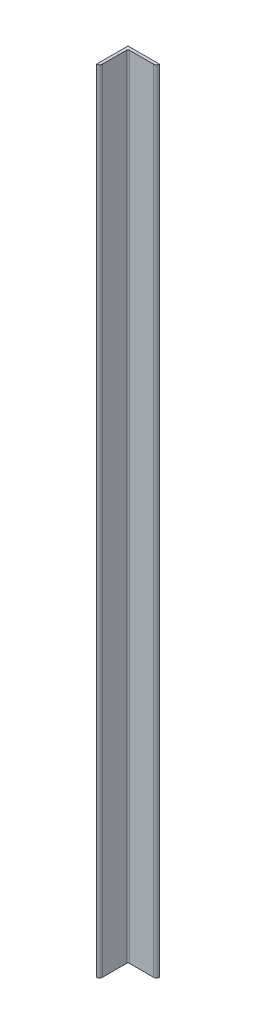
ISO-10303-21;
HEADER;
FILE_DESCRIPTION(('STEP AP214'),'2;1');
FILE_NAME('part.step','',(''),(''),'','','');
FILE_SCHEMA(('AUTOMOTIVE_DESIGN { 1 0 10303 214 1 1 1 1 }'));
ENDSEC;
DATA;
#1=APPLICATION_CONTEXT('core data for automotive mechanical design processes');
#2=APPLICATION_PROTOCOL_DEFINITION('international standard','automotive_design',2000,#1);
#3=PRODUCT_CONTEXT('',#1,'mechanical');
#4=PRODUCT('Part','Part','',(#3));
#5=PRODUCT_RELATED_PRODUCT_CATEGORY('part','',(#4));
#6=PRODUCT_DEFINITION_FORMATION('','',#4);
#7=PRODUCT_DEFINITION_CONTEXT('part definition',#1,'design');
#8=PRODUCT_DEFINITION('design','',#6,#7);
#9=PRODUCT_DEFINITION_SHAPE('','',#8);
#10=(LENGTH_UNIT() NAMED_UNIT(*) SI_UNIT(.MILLI.,.METRE.));
#11=(NAMED_UNIT(*) PLANE_ANGLE_UNIT() SI_UNIT($,.RADIAN.));
#12=(NAMED_UNIT(*) SI_UNIT($,.STERADIAN.) SOLID_ANGLE_UNIT());
#13=UNCERTAINTY_MEASURE_WITH_UNIT(LENGTH_MEASURE(1.E-05),#10,'distance_accuracy_value','');
#14=(GEOMETRIC_REPRESENTATION_CONTEXT(3) GLOBAL_UNCERTAINTY_ASSIGNED_CONTEXT((#13)) GLOBAL_UNIT_ASSIGNED_CONTEXT((#10,
#11,#12)) REPRESENTATION_CONTEXT('',''));
#15=CARTESIAN_POINT('',(0.,0.,0.));
#16=DIRECTION('',(0.,0.,1.));
#17=DIRECTION('',(1.,0.,0.));
#18=AXIS2_PLACEMENT_3D('',#15,#16,#17);
#19=CARTESIAN_POINT('',(92.08008,-1280.,0.00507999999993514));
#20=DIRECTION('',(0.,-1.,0.));
#21=DIRECTION('',(0.,0.,-1.));
#22=AXIS2_PLACEMENT_3D('',#19,#20,#21);
#23=PLANE('',#22);
#24=DIRECTION('',(0.,0.,1.));
#25=VECTOR('',#24,1.);
#26=CARTESIAN_POINT('',(0.,-1280.,101.6));
#27=LINE('',#26,#25);
#28=CARTESIAN_POINT('',(0.,-1280.,0.));
#29=VERTEX_POINT('',#28);
#30=CARTESIAN_POINT('',(0.,-1280.,101.6));
#31=VERTEX_POINT('',#30);
#32=EDGE_CURVE('E145',#29,#31,#27,.T.);
#33=ORIENTED_EDGE('',*,*,#32,.F.);
#34=DIRECTION('',(-1.,0.,0.));
#35=VECTOR('',#34,1.);
#36=CARTESIAN_POINT('',(0.,-1280.,0.));
#37=LINE('',#36,#35);
#38=CARTESIAN_POINT('',(101.6,-1280.,0.));
#39=VERTEX_POINT('',#38);
#40=EDGE_CURVE('E27',#39,#29,#37,.T.);
#41=ORIENTED_EDGE('',*,*,#40,.F.);
#42=DIRECTION('',(0.,0.,-1.));
#43=VECTOR('',#42,1.);
#44=CARTESIAN_POINT('',(101.6,-1280.,0.));
#45=LINE('',#44,#43);
#46=CARTESIAN_POINT('',(101.6,-1280.,0.00507999999993514));
#47=VERTEX_POINT('',#46);
#48=EDGE_CURVE('E149',#47,#39,#45,.T.);
#49=ORIENTED_EDGE('',*,*,#48,.F.);
#50=CARTESIAN_POINT('',(92.08008,-1280.,0.00507999999993514));
#51=DIRECTION('',(0.,1.,0.));
#52=DIRECTION('',(0.,0.,-1.));
#53=AXIS2_PLACEMENT_3D('',#50,#51,#52);
#54=CIRCLE('',#53,9.51992);
#55=CARTESIAN_POINT('',(92.08008,-1280.,9.525));
#56=VERTEX_POINT('',#55);
#57=EDGE_CURVE('E198',#56,#47,#54,.T.);
#58=ORIENTED_EDGE('',*,*,#57,.F.);
#59=DIRECTION('',(1.,0.,0.));
#60=VECTOR('',#59,1.);
#61=CARTESIAN_POINT('',(92.08008,-1280.,9.525));
#62=LINE('',#61,#60);
#63=CARTESIAN_POINT('',(14.2875,-1280.,9.525));
#64=VERTEX_POINT('',#63);
#65=EDGE_CURVE('E20',#64,#56,#62,.T.);
#66=ORIENTED_EDGE('',*,*,#65,.F.);
#67=CARTESIAN_POINT('',(14.2875,-1280.,14.2875));
#68=DIRECTION('',(0.,-1.,0.));
#69=DIRECTION('',(0.,0.,-1.));
#70=AXIS2_PLACEMENT_3D('',#67,#68,#69);
#71=CIRCLE('',#70,4.7625);
#72=CARTESIAN_POINT('',(9.525,-1280.,14.2875));
#73=VERTEX_POINT('',#72);
#74=EDGE_CURVE('E186',#73,#64,#71,.T.);
#75=ORIENTED_EDGE('',*,*,#74,.F.);
#76=DIRECTION('',(0.,0.,-1.));
#77=VECTOR('',#76,1.);
#78=CARTESIAN_POINT('',(9.525,-1280.,14.2875));
#79=LINE('',#78,#77);
#80=CARTESIAN_POINT('',(9.525,-1280.,92.08008));
#81=VERTEX_POINT('',#80);
#82=EDGE_CURVE('E119',#81,#73,#79,.T.);
#83=ORIENTED_EDGE('',*,*,#82,.F.);
#84=CARTESIAN_POINT('',(0.00507999999999065,-1280.,92.08008));
#85=DIRECTION('',(0.,1.,0.));
#86=DIRECTION('',(0.,0.,1.));
#87=AXIS2_PLACEMENT_3D('',#84,#85,#86);
#88=CIRCLE('',#87,9.51992);
#89=CARTESIAN_POINT('',(0.00507999999999065,-1280.,101.6));
#90=VERTEX_POINT('',#89);
#91=EDGE_CURVE('E130',#90,#81,#88,.T.);
#92=ORIENTED_EDGE('',*,*,#91,.F.);
#93=DIRECTION('',(1.,0.,0.));
#94=VECTOR('',#93,1.);
#95=CARTESIAN_POINT('',(0.00507999999999065,-1280.,101.6));
#96=LINE('',#95,#94);
#97=EDGE_CURVE('E133',#31,#90,#96,.T.);
#98=ORIENTED_EDGE('',*,*,#97,.F.);
#99=EDGE_LOOP('',(#33,#41,#49,#58,#66,#75,#83,#92,#98));
#100=FACE_BOUND('',#99,.T.);
#101=ADVANCED_FACE('F16',(#100),#23,.T.);
#102=CARTESIAN_POINT('',(92.08008,1280.,0.00507999999993514));
#103=DIRECTION('',(0.,-1.,0.));
#104=DIRECTION('',(0.,0.,-1.));
#105=AXIS2_PLACEMENT_3D('',#102,#103,#104);
#106=PLANE('',#105);
#107=DIRECTION('',(0.,0.,1.));
#108=VECTOR('',#107,1.);
#109=CARTESIAN_POINT('',(0.,1280.,101.6));
#110=LINE('',#109,#108);
#111=CARTESIAN_POINT('',(0.,1280.,0.));
#112=VERTEX_POINT('',#111);
#113=CARTESIAN_POINT('',(0.,1280.,101.6));
#114=VERTEX_POINT('',#113);
#115=EDGE_CURVE('E125',#112,#114,#110,.T.);
#116=ORIENTED_EDGE('',*,*,#115,.T.);
#117=DIRECTION('',(1.,0.,0.));
#118=VECTOR('',#117,1.);
#119=CARTESIAN_POINT('',(0.00507999999999065,1280.,101.6));
#120=LINE('',#119,#118);
#121=CARTESIAN_POINT('',(0.00507999999999065,1280.,101.6));
#122=VERTEX_POINT('',#121);
#123=EDGE_CURVE('E122',#114,#122,#120,.T.);
#124=ORIENTED_EDGE('',*,*,#123,.T.);
#125=CARTESIAN_POINT('',(0.00507999999999065,1280.,92.08008));
#126=DIRECTION('',(0.,1.,0.));
#127=DIRECTION('',(0.,0.,1.));
#128=AXIS2_PLACEMENT_3D('',#125,#126,#127);
#129=CIRCLE('',#128,9.51992);
#130=CARTESIAN_POINT('',(9.525,1280.,92.08008));
#131=VERTEX_POINT('',#130);
#132=EDGE_CURVE('E107',#122,#131,#129,.T.);
#133=ORIENTED_EDGE('',*,*,#132,.T.);
#134=DIRECTION('',(0.,0.,-1.));
#135=VECTOR('',#134,1.);
#136=CARTESIAN_POINT('',(9.525,1280.,14.2875));
#137=LINE('',#136,#135);
#138=CARTESIAN_POINT('',(9.525,1280.,14.2875));
#139=VERTEX_POINT('',#138);
#140=EDGE_CURVE('E153',#131,#139,#137,.T.);
#141=ORIENTED_EDGE('',*,*,#140,.T.);
#142=CARTESIAN_POINT('',(14.2875,1280.,14.2875));
#143=DIRECTION('',(0.,-1.,0.));
#144=DIRECTION('',(0.,0.,-1.));
#145=AXIS2_PLACEMENT_3D('',#142,#143,#144);
#146=CIRCLE('',#145,4.7625);
#147=CARTESIAN_POINT('',(14.2875,1280.,9.525));
#148=VERTEX_POINT('',#147);
#149=EDGE_CURVE('E155',#139,#148,#146,.T.);
#150=ORIENTED_EDGE('',*,*,#149,.T.);
#151=DIRECTION('',(1.,0.,0.));
#152=VECTOR('',#151,1.);
#153=CARTESIAN_POINT('',(92.08008,1280.,9.525));
#154=LINE('',#153,#152);
#155=CARTESIAN_POINT('',(92.08008,1280.,9.525));
#156=VERTEX_POINT('',#155);
#157=EDGE_CURVE('E168',#148,#156,#154,.T.);
#158=ORIENTED_EDGE('',*,*,#157,.T.);
#159=CARTESIAN_POINT('',(92.08008,1280.,0.00507999999993514));
#160=DIRECTION('',(0.,1.,0.));
#161=DIRECTION('',(0.,0.,-1.));
#162=AXIS2_PLACEMENT_3D('',#159,#160,#161);
#163=CIRCLE('',#162,9.51992);
#164=CARTESIAN_POINT('',(101.6,1280.,0.00507999999993514));
#165=VERTEX_POINT('',#164);
#166=EDGE_CURVE('E162',#156,#165,#163,.T.);
#167=ORIENTED_EDGE('',*,*,#166,.T.);
#168=DIRECTION('',(0.,0.,-1.));
#169=VECTOR('',#168,1.);
#170=CARTESIAN_POINT('',(101.6,1280.,0.));
#171=LINE('',#170,#169);
#172=CARTESIAN_POINT('',(101.6,1280.,0.));
#173=VERTEX_POINT('',#172);
#174=EDGE_CURVE('E148',#165,#173,#171,.T.);
#175=ORIENTED_EDGE('',*,*,#174,.T.);
#176=DIRECTION('',(-1.,0.,0.));
#177=VECTOR('',#176,1.);
#178=CARTESIAN_POINT('',(0.,1280.,0.));
#179=LINE('',#178,#177);
#180=EDGE_CURVE('E11',#173,#112,#179,.T.);
#181=ORIENTED_EDGE('',*,*,#180,.T.);
#182=EDGE_LOOP('',(#116,#124,#133,#141,#150,#158,#167,#175,#181));
#183=FACE_BOUND('',#182,.T.);
#184=ADVANCED_FACE('F123',(#183),#106,.F.);
#185=CARTESIAN_POINT('',(0.,1280.,0.));
#186=DIRECTION('',(0.,0.,1.));
#187=DIRECTION('',(1.,0.,0.));
#188=AXIS2_PLACEMENT_3D('',#185,#186,#187);
#189=PLANE('',#188);
#190=ORIENTED_EDGE('',*,*,#40,.T.);
#191=DIRECTION('',(0.,-1.,0.));
#192=VECTOR('',#191,1.);
#193=CARTESIAN_POINT('',(0.,1280.,0.));
#194=LINE('',#193,#192);
#195=EDGE_CURVE('E141',#112,#29,#194,.T.);
#196=ORIENTED_EDGE('',*,*,#195,.F.);
#197=ORIENTED_EDGE('',*,*,#180,.F.);
#198=DIRECTION('',(0.,-1.,0.));
#199=VECTOR('',#198,1.);
#200=CARTESIAN_POINT('',(101.6,1280.,0.));
#201=LINE('',#200,#199);
#202=EDGE_CURVE('E146',#173,#39,#201,.T.);
#203=ORIENTED_EDGE('',*,*,#202,.T.);
#204=EDGE_LOOP('',(#190,#196,#197,#203));
#205=FACE_BOUND('',#204,.T.);
#206=ADVANCED_FACE('F254',(#205),#189,.F.);
#207=CARTESIAN_POINT('',(101.6,1280.,0.));
#208=DIRECTION('',(-1.,0.,0.));
#209=DIRECTION('',(0.,0.,1.));
#210=AXIS2_PLACEMENT_3D('',#207,#208,#209);
#211=PLANE('',#210);
#212=ORIENTED_EDGE('',*,*,#48,.T.);
#213=ORIENTED_EDGE('',*,*,#202,.F.);
#214=ORIENTED_EDGE('',*,*,#174,.F.);
#215=DIRECTION('',(0.,-1.,0.));
#216=VECTOR('',#215,1.);
#217=CARTESIAN_POINT('',(101.6,1280.,0.00507999999993514));
#218=LINE('',#217,#216);
#219=EDGE_CURVE('E204',#165,#47,#218,.T.);
#220=ORIENTED_EDGE('',*,*,#219,.T.);
#221=EDGE_LOOP('',(#212,#213,#214,#220));
#222=FACE_BOUND('',#221,.T.);
#223=ADVANCED_FACE('F18',(#222),#211,.F.);
#224=CARTESIAN_POINT('',(92.08008,1280.,0.00507999999993514));
#225=DIRECTION('',(0.,-1.,0.));
#226=DIRECTION('',(0.,0.,-1.));
#227=AXIS2_PLACEMENT_3D('',#224,#225,#226);
#228=CYLINDRICAL_SURFACE('',#227,9.51992);
#229=ORIENTED_EDGE('',*,*,#57,.T.);
#230=ORIENTED_EDGE('',*,*,#219,.F.);
#231=ORIENTED_EDGE('',*,*,#166,.F.);
#232=DIRECTION('',(0.,-1.,0.));
#233=VECTOR('',#232,1.);
#234=CARTESIAN_POINT('',(92.08008,1280.,9.525));
#235=LINE('',#234,#233);
#236=EDGE_CURVE('E164',#156,#56,#235,.T.);
#237=ORIENTED_EDGE('',*,*,#236,.T.);
#238=EDGE_LOOP('',(#229,#230,#231,#237));
#239=FACE_BOUND('',#238,.T.);
#240=ADVANCED_FACE('F253',(#239),#228,.T.);
#241=CARTESIAN_POINT('',(92.08008,1280.,9.525));
#242=DIRECTION('',(0.,0.,-1.));
#243=DIRECTION('',(-1.,0.,0.));
#244=AXIS2_PLACEMENT_3D('',#241,#242,#243);
#245=PLANE('',#244);
#246=ORIENTED_EDGE('',*,*,#65,.T.);
#247=ORIENTED_EDGE('',*,*,#236,.F.);
#248=ORIENTED_EDGE('',*,*,#157,.F.);
#249=DIRECTION('',(0.,-1.,0.));
#250=VECTOR('',#249,1.);
#251=CARTESIAN_POINT('',(14.2875,1280.,9.525));
#252=LINE('',#251,#250);
#253=EDGE_CURVE('E159',#148,#64,#252,.T.);
#254=ORIENTED_EDGE('',*,*,#253,.T.);
#255=EDGE_LOOP('',(#246,#247,#248,#254));
#256=FACE_BOUND('',#255,.T.);
#257=ADVANCED_FACE('F264',(#256),#245,.F.);
#258=CARTESIAN_POINT('',(14.2875,1280.,14.2875));
#259=DIRECTION('',(0.,-1.,0.));
#260=DIRECTION('',(0.,0.,-1.));
#261=AXIS2_PLACEMENT_3D('',#258,#259,#260);
#262=CYLINDRICAL_SURFACE('',#261,4.7625);
#263=ORIENTED_EDGE('',*,*,#74,.T.);
#264=ORIENTED_EDGE('',*,*,#253,.F.);
#265=ORIENTED_EDGE('',*,*,#149,.F.);
#266=DIRECTION('',(0.,-1.,0.));
#267=VECTOR('',#266,1.);
#268=CARTESIAN_POINT('',(9.525,1280.,14.2875));
#269=LINE('',#268,#267);
#270=EDGE_CURVE('E150',#139,#73,#269,.T.);
#271=ORIENTED_EDGE('',*,*,#270,.T.);
#272=EDGE_LOOP('',(#263,#264,#265,#271));
#273=FACE_BOUND('',#272,.T.);
#274=ADVANCED_FACE('F269',(#273),#262,.F.);
#275=CARTESIAN_POINT('',(9.525,1280.,14.2875));
#276=DIRECTION('',(-1.,0.,0.));
#277=DIRECTION('',(0.,0.,1.));
#278=AXIS2_PLACEMENT_3D('',#275,#276,#277);
#279=PLANE('',#278);
#280=ORIENTED_EDGE('',*,*,#82,.T.);
#281=ORIENTED_EDGE('',*,*,#270,.F.);
#282=ORIENTED_EDGE('',*,*,#140,.F.);
#283=DIRECTION('',(0.,-1.,0.));
#284=VECTOR('',#283,1.);
#285=CARTESIAN_POINT('',(9.525,1280.,92.08008));
#286=LINE('',#285,#284);
#287=EDGE_CURVE('E115',#131,#81,#286,.T.);
#288=ORIENTED_EDGE('',*,*,#287,.T.);
#289=EDGE_LOOP('',(#280,#281,#282,#288));
#290=FACE_BOUND('',#289,.T.);
#291=ADVANCED_FACE('F234',(#290),#279,.F.);
#292=CARTESIAN_POINT('',(0.00507999999999065,1280.,92.08008));
#293=DIRECTION('',(0.,-1.,0.));
#294=DIRECTION('',(0.,0.,-1.));
#295=AXIS2_PLACEMENT_3D('',#292,#293,#294);
#296=CYLINDRICAL_SURFACE('',#295,9.51992);
#297=ORIENTED_EDGE('',*,*,#91,.T.);
#298=ORIENTED_EDGE('',*,*,#287,.F.);
#299=ORIENTED_EDGE('',*,*,#132,.F.);
#300=DIRECTION('',(0.,-1.,0.));
#301=VECTOR('',#300,1.);
#302=CARTESIAN_POINT('',(0.00507999999999065,1280.,101.6));
#303=LINE('',#302,#301);
#304=EDGE_CURVE('E112',#122,#90,#303,.T.);
#305=ORIENTED_EDGE('',*,*,#304,.T.);
#306=EDGE_LOOP('',(#297,#298,#299,#305));
#307=FACE_BOUND('',#306,.T.);
#308=ADVANCED_FACE('F110',(#307),#296,.T.);
#309=CARTESIAN_POINT('',(0.00507999999999065,1280.,101.6));
#310=DIRECTION('',(0.,0.,-1.));
#311=DIRECTION('',(0.,-1.,0.));
#312=AXIS2_PLACEMENT_3D('',#309,#310,#311);
#313=PLANE('',#312);
#314=ORIENTED_EDGE('',*,*,#97,.T.);
#315=ORIENTED_EDGE('',*,*,#304,.F.);
#316=ORIENTED_EDGE('',*,*,#123,.F.);
#317=DIRECTION('',(0.,-1.,0.));
#318=VECTOR('',#317,1.);
#319=CARTESIAN_POINT('',(0.,1280.,101.6));
#320=LINE('',#319,#318);
#321=EDGE_CURVE('E170',#114,#31,#320,.T.);
#322=ORIENTED_EDGE('',*,*,#321,.T.);
#323=EDGE_LOOP('',(#314,#315,#316,#322));
#324=FACE_BOUND('',#323,.T.);
#325=ADVANCED_FACE('F132',(#324),#313,.F.);
#326=CARTESIAN_POINT('',(0.,1280.,101.6));
#327=DIRECTION('',(1.,0.,0.));
#328=DIRECTION('',(0.,0.,1.));
#329=AXIS2_PLACEMENT_3D('',#326,#327,#328);
#330=PLANE('',#329);
#331=ORIENTED_EDGE('',*,*,#32,.T.);
#332=ORIENTED_EDGE('',*,*,#321,.F.);
#333=ORIENTED_EDGE('',*,*,#115,.F.);
#334=ORIENTED_EDGE('',*,*,#195,.T.);
#335=EDGE_LOOP('',(#331,#332,#333,#334));
#336=FACE_BOUND('',#335,.T.);
#337=ADVANCED_FACE('F228',(#336),#330,.F.);
#338=CLOSED_SHELL('',(#101,#184,#206,#223,#240,#257,#274,#291,#308,#325,#337));
#339=MANIFOLD_SOLID_BREP('B1',#338);
#340=ADVANCED_BREP_SHAPE_REPRESENTATION('',(#18,#339),#14);
#341=SHAPE_DEFINITION_REPRESENTATION(#9,#340);
ENDSEC;
END-ISO-10303-21;
